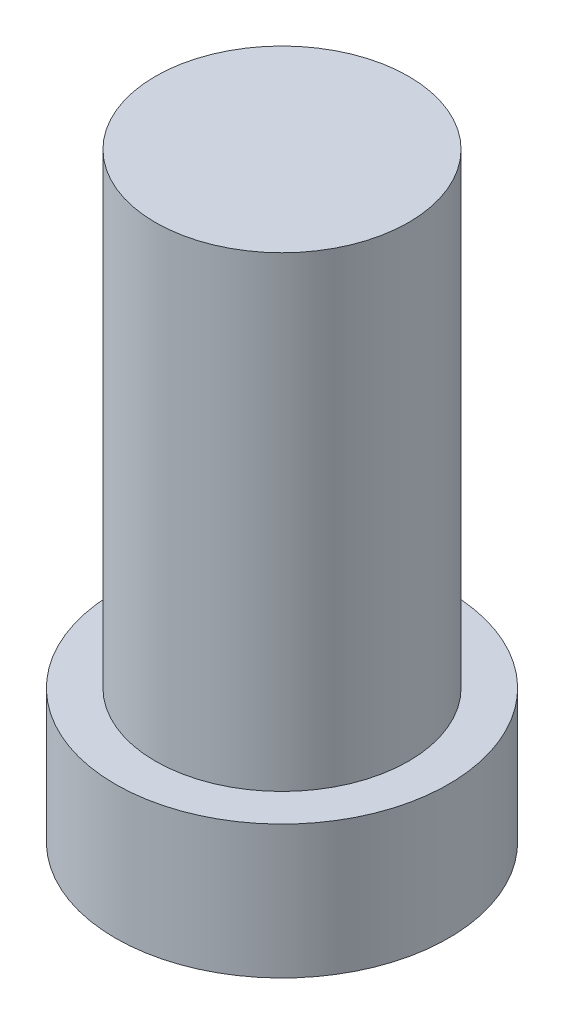
ISO-10303-21;
HEADER;
FILE_DESCRIPTION(('STEP AP214'),'2;1');
FILE_NAME('part.step','',(''),(''),'','','');
FILE_SCHEMA(('AUTOMOTIVE_DESIGN { 1 0 10303 214 1 1 1 1 }'));
ENDSEC;
DATA;
#1=APPLICATION_CONTEXT('core data for automotive mechanical design processes');
#2=APPLICATION_PROTOCOL_DEFINITION('international standard','automotive_design',2000,#1);
#3=PRODUCT_CONTEXT('',#1,'mechanical');
#4=PRODUCT('Part','Part','',(#3));
#5=PRODUCT_RELATED_PRODUCT_CATEGORY('part','',(#4));
#6=PRODUCT_DEFINITION_FORMATION('','',#4);
#7=PRODUCT_DEFINITION_CONTEXT('part definition',#1,'design');
#8=PRODUCT_DEFINITION('design','',#6,#7);
#9=PRODUCT_DEFINITION_SHAPE('','',#8);
#10=(LENGTH_UNIT() NAMED_UNIT(*) SI_UNIT(.MILLI.,.METRE.));
#11=(NAMED_UNIT(*) PLANE_ANGLE_UNIT() SI_UNIT($,.RADIAN.));
#12=(NAMED_UNIT(*) SI_UNIT($,.STERADIAN.) SOLID_ANGLE_UNIT());
#13=UNCERTAINTY_MEASURE_WITH_UNIT(LENGTH_MEASURE(1.E-05),#10,'distance_accuracy_value','');
#14=(GEOMETRIC_REPRESENTATION_CONTEXT(3) GLOBAL_UNCERTAINTY_ASSIGNED_CONTEXT((#13)) GLOBAL_UNIT_ASSIGNED_CONTEXT((#10,
#11,#12)) REPRESENTATION_CONTEXT('',''));
#15=CARTESIAN_POINT('',(0.,0.,0.));
#16=DIRECTION('',(0.,0.,1.));
#17=DIRECTION('',(1.,0.,0.));
#18=AXIS2_PLACEMENT_3D('',#15,#16,#17);
#19=CARTESIAN_POINT('',(0.,4.,0.));
#20=DIRECTION('',(0.,-1.,0.));
#21=DIRECTION('',(0.,0.,-1.));
#22=AXIS2_PLACEMENT_3D('',#19,#20,#21);
#23=CYLINDRICAL_SURFACE('',#22,5.);
#24=CARTESIAN_POINT('',(0.,4.,0.));
#25=DIRECTION('',(0.,1.,0.));
#26=DIRECTION('',(0.,0.,1.));
#27=AXIS2_PLACEMENT_3D('',#24,#25,#26);
#28=CIRCLE('',#27,5.);
#29=CARTESIAN_POINT('',(0.,4.,5.));
#30=VERTEX_POINT('',#29);
#31=EDGE_CURVE('E40',#30,#30,#28,.T.);
#32=ORIENTED_EDGE('',*,*,#31,.F.);
#33=EDGE_LOOP('',(#32));
#34=FACE_BOUND('',#33,.T.);
#35=CARTESIAN_POINT('',(0.,0.,0.));
#36=DIRECTION('',(0.,1.,0.));
#37=DIRECTION('',(0.,0.,1.));
#38=AXIS2_PLACEMENT_3D('',#35,#36,#37);
#39=CIRCLE('',#38,5.);
#40=CARTESIAN_POINT('',(0.,0.,5.));
#41=VERTEX_POINT('',#40);
#42=EDGE_CURVE('E36',#41,#41,#39,.T.);
#43=ORIENTED_EDGE('',*,*,#42,.T.);
#44=EDGE_LOOP('',(#43));
#45=FACE_BOUND('',#44,.T.);
#46=ADVANCED_FACE('F33',(#34,#45),#23,.T.);
#47=CARTESIAN_POINT('',(0.,4.,0.));
#48=DIRECTION('',(0.,1.,0.));
#49=DIRECTION('',(0.,0.,1.));
#50=AXIS2_PLACEMENT_3D('',#47,#48,#49);
#51=PLANE('',#50);
#52=CARTESIAN_POINT('',(0.,4.,0.));
#53=DIRECTION('',(0.,1.,0.));
#54=DIRECTION('',(0.,0.,1.));
#55=AXIS2_PLACEMENT_3D('',#52,#53,#54);
#56=CIRCLE('',#55,3.8);
#57=CARTESIAN_POINT('',(0.,4.,3.8));
#58=VERTEX_POINT('',#57);
#59=EDGE_CURVE('E10',#58,#58,#56,.T.);
#60=ORIENTED_EDGE('',*,*,#59,.F.);
#61=EDGE_LOOP('',(#60));
#62=FACE_BOUND('',#61,.T.);
#63=ORIENTED_EDGE('',*,*,#31,.T.);
#64=EDGE_LOOP('',(#63));
#65=FACE_BOUND('',#64,.T.);
#66=ADVANCED_FACE('F82',(#62,#65),#51,.T.);
#67=CARTESIAN_POINT('',(0.,0.,0.));
#68=DIRECTION('',(0.,1.,0.));
#69=DIRECTION('',(0.,0.,1.));
#70=AXIS2_PLACEMENT_3D('',#67,#68,#69);
#71=PLANE('',#70);
#72=CARTESIAN_POINT('',(0.,0.,0.));
#73=DIRECTION('',(0.,-1.,0.));
#74=DIRECTION('',(0.,0.,-1.));
#75=AXIS2_PLACEMENT_3D('',#72,#73,#74);
#76=CIRCLE('',#75,3.5);
#77=CARTESIAN_POINT('',(0.,0.,-3.5));
#78=VERTEX_POINT('',#77);
#79=EDGE_CURVE('E50',#78,#78,#76,.T.);
#80=ORIENTED_EDGE('',*,*,#79,.F.);
#81=EDGE_LOOP('',(#80));
#82=FACE_BOUND('',#81,.T.);
#83=ORIENTED_EDGE('',*,*,#42,.F.);
#84=EDGE_LOOP('',(#83));
#85=FACE_BOUND('',#84,.T.);
#86=ADVANCED_FACE('F78',(#82,#85),#71,.F.);
#87=CARTESIAN_POINT('',(0.,18.,0.));
#88=DIRECTION('',(0.,-1.,0.));
#89=DIRECTION('',(0.,0.,-1.));
#90=AXIS2_PLACEMENT_3D('',#87,#88,#89);
#91=CYLINDRICAL_SURFACE('',#90,3.8);
#92=CARTESIAN_POINT('',(0.,18.,0.));
#93=DIRECTION('',(0.,1.,0.));
#94=DIRECTION('',(0.,0.,1.));
#95=AXIS2_PLACEMENT_3D('',#92,#93,#94);
#96=CIRCLE('',#95,3.8);
#97=CARTESIAN_POINT('',(0.,18.,3.8));
#98=VERTEX_POINT('',#97);
#99=EDGE_CURVE('E46',#98,#98,#96,.T.);
#100=ORIENTED_EDGE('',*,*,#99,.F.);
#101=EDGE_LOOP('',(#100));
#102=FACE_BOUND('',#101,.T.);
#103=ORIENTED_EDGE('',*,*,#59,.T.);
#104=EDGE_LOOP('',(#103));
#105=FACE_BOUND('',#104,.T.);
#106=ADVANCED_FACE('F81',(#102,#105),#91,.T.);
#107=CARTESIAN_POINT('',(0.,18.,0.));
#108=DIRECTION('',(0.,1.,0.));
#109=DIRECTION('',(0.,0.,1.));
#110=AXIS2_PLACEMENT_3D('',#107,#108,#109);
#111=PLANE('',#110);
#112=ORIENTED_EDGE('',*,*,#99,.T.);
#113=EDGE_LOOP('',(#112));
#114=FACE_BOUND('',#113,.T.);
#115=ADVANCED_FACE('F74',(#114),#111,.T.);
#116=CARTESIAN_POINT('',(0.,3.,0.));
#117=DIRECTION('',(0.,-1.,0.));
#118=DIRECTION('',(0.,0.,-1.));
#119=AXIS2_PLACEMENT_3D('',#116,#117,#118);
#120=CYLINDRICAL_SURFACE('',#119,3.5);
#121=CARTESIAN_POINT('',(0.,3.,0.));
#122=DIRECTION('',(0.,-1.,0.));
#123=DIRECTION('',(0.,0.,-1.));
#124=AXIS2_PLACEMENT_3D('',#121,#122,#123);
#125=CIRCLE('',#124,3.5);
#126=CARTESIAN_POINT('',(0.,3.,-3.5));
#127=VERTEX_POINT('',#126);
#128=EDGE_CURVE('E49',#127,#127,#125,.T.);
#129=ORIENTED_EDGE('',*,*,#128,.F.);
#130=EDGE_LOOP('',(#129));
#131=FACE_BOUND('',#130,.T.);
#132=ORIENTED_EDGE('',*,*,#79,.T.);
#133=EDGE_LOOP('',(#132));
#134=FACE_BOUND('',#133,.T.);
#135=ADVANCED_FACE('F68',(#131,#134),#120,.F.);
#136=CARTESIAN_POINT('',(0.,3.,0.));
#137=DIRECTION('',(0.,-1.,0.));
#138=DIRECTION('',(0.,0.,-1.));
#139=AXIS2_PLACEMENT_3D('',#136,#137,#138);
#140=PLANE('',#139);
#141=CARTESIAN_POINT('',(0.,3.,0.));
#142=DIRECTION('',(0.,-1.,0.));
#143=DIRECTION('',(0.,0.,-1.));
#144=AXIS2_PLACEMENT_3D('',#141,#142,#143);
#145=CIRCLE('',#144,0.75);
#146=CARTESIAN_POINT('',(0.,3.,-0.75));
#147=VERTEX_POINT('',#146);
#148=EDGE_CURVE('E53',#147,#147,#145,.T.);
#149=ORIENTED_EDGE('',*,*,#148,.F.);
#150=EDGE_LOOP('',(#149));
#151=FACE_BOUND('',#150,.T.);
#152=ORIENTED_EDGE('',*,*,#128,.T.);
#153=EDGE_LOOP('',(#152));
#154=FACE_BOUND('',#153,.T.);
#155=ADVANCED_FACE('F65',(#151,#154),#140,.T.);
#156=CARTESIAN_POINT('',(0.,3.,0.));
#157=DIRECTION('',(0.,-1.,0.));
#158=DIRECTION('',(0.,0.,-1.));
#159=AXIS2_PLACEMENT_3D('',#156,#157,#158);
#160=CYLINDRICAL_SURFACE('',#159,0.75);
#161=ORIENTED_EDGE('',*,*,#148,.T.);
#162=EDGE_LOOP('',(#161));
#163=FACE_BOUND('',#162,.T.);
#164=CARTESIAN_POINT('',(0.,0.,0.));
#165=DIRECTION('',(0.,-1.,0.));
#166=DIRECTION('',(0.,0.,-1.));
#167=AXIS2_PLACEMENT_3D('',#164,#165,#166);
#168=CIRCLE('',#167,0.75);
#169=CARTESIAN_POINT('',(0.,0.,-0.75));
#170=VERTEX_POINT('',#169);
#171=EDGE_CURVE('E56',#170,#170,#168,.T.);
#172=ORIENTED_EDGE('',*,*,#171,.F.);
#173=EDGE_LOOP('',(#172));
#174=FACE_BOUND('',#173,.T.);
#175=ADVANCED_FACE('F62',(#163,#174),#160,.T.);
#176=ORIENTED_EDGE('',*,*,#171,.T.);
#177=EDGE_LOOP('',(#176));
#178=FACE_BOUND('',#177,.T.);
#179=ADVANCED_FACE('F83',(#178),#71,.F.);
#180=CLOSED_SHELL('',(#46,#66,#86,#106,#115,#135,#155,#175,#179));
#181=MANIFOLD_SOLID_BREP('B2',#180);
#182=ADVANCED_BREP_SHAPE_REPRESENTATION('',(#18,#181),#14);
#183=SHAPE_DEFINITION_REPRESENTATION(#9,#182);
ENDSEC;
END-ISO-10303-21;
